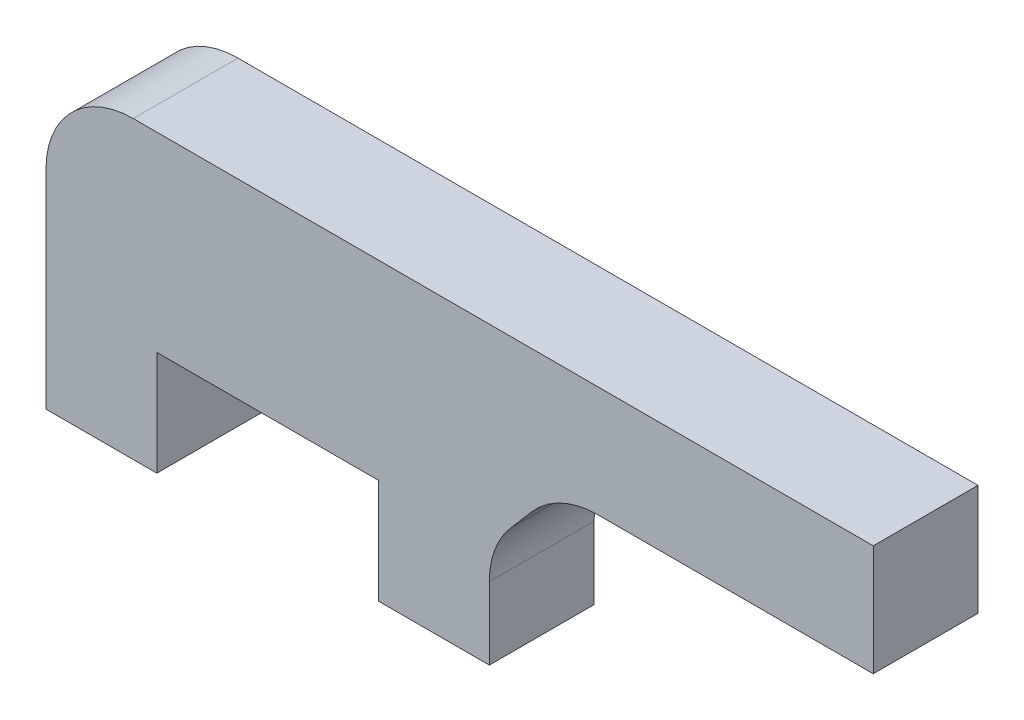
ISO-10303-21;
HEADER;
FILE_DESCRIPTION(('STEP AP214'),'2;1');
FILE_NAME('part.step','',(''),(''),'','','');
FILE_SCHEMA(('AUTOMOTIVE_DESIGN { 1 0 10303 214 1 1 1 1 }'));
ENDSEC;
DATA;
#1=APPLICATION_CONTEXT('core data for automotive mechanical design processes');
#2=APPLICATION_PROTOCOL_DEFINITION('international standard','automotive_design',2000,#1);
#3=PRODUCT_CONTEXT('',#1,'mechanical');
#4=PRODUCT('Part','Part','',(#3));
#5=PRODUCT_RELATED_PRODUCT_CATEGORY('part','',(#4));
#6=PRODUCT_DEFINITION_FORMATION('','',#4);
#7=PRODUCT_DEFINITION_CONTEXT('part definition',#1,'design');
#8=PRODUCT_DEFINITION('design','',#6,#7);
#9=PRODUCT_DEFINITION_SHAPE('','',#8);
#10=(LENGTH_UNIT() NAMED_UNIT(*) SI_UNIT(.MILLI.,.METRE.));
#11=(NAMED_UNIT(*) PLANE_ANGLE_UNIT() SI_UNIT($,.RADIAN.));
#12=(NAMED_UNIT(*) SI_UNIT($,.STERADIAN.) SOLID_ANGLE_UNIT());
#13=UNCERTAINTY_MEASURE_WITH_UNIT(LENGTH_MEASURE(1.E-05),#10,'distance_accuracy_value','');
#14=(GEOMETRIC_REPRESENTATION_CONTEXT(3) GLOBAL_UNCERTAINTY_ASSIGNED_CONTEXT((#13)) GLOBAL_UNIT_ASSIGNED_CONTEXT((#10,
#11,#12)) REPRESENTATION_CONTEXT('',''));
#15=CARTESIAN_POINT('',(0.,0.,0.));
#16=DIRECTION('',(0.,0.,1.));
#17=DIRECTION('',(1.,0.,0.));
#18=AXIS2_PLACEMENT_3D('',#15,#16,#17);
#19=CARTESIAN_POINT('',(642.289802478891,52.5443999999839,6.));
#20=DIRECTION('',(0.,0.,-1.));
#21=DIRECTION('',(-1.,0.,0.));
#22=AXIS2_PLACEMENT_3D('',#19,#20,#21);
#23=CYLINDRICAL_SURFACE('',#22,5.);
#24=CARTESIAN_POINT('',(642.289802478891,52.5443999999839,0.));
#25=DIRECTION('',(0.,0.,1.));
#26=DIRECTION('',(1.,0.,0.));
#27=AXIS2_PLACEMENT_3D('',#24,#25,#26);
#28=CIRCLE('',#27,5.);
#29=CARTESIAN_POINT('',(642.289802478891,57.5443999999839,0.));
#30=VERTEX_POINT('',#29);
#31=CARTESIAN_POINT('',(637.289802478891,52.5443999999839,0.));
#32=VERTEX_POINT('',#31);
#33=EDGE_CURVE('E167',#30,#32,#28,.T.);
#34=ORIENTED_EDGE('',*,*,#33,.T.);
#35=DIRECTION('',(0.,0.,-1.));
#36=VECTOR('',#35,1.);
#37=CARTESIAN_POINT('',(637.289802478891,52.5443999999839,6.));
#38=LINE('',#37,#36);
#39=CARTESIAN_POINT('',(637.289802478891,52.5443999999839,6.));
#40=VERTEX_POINT('',#39);
#41=EDGE_CURVE('E41',#40,#32,#38,.T.);
#42=ORIENTED_EDGE('',*,*,#41,.F.);
#43=CARTESIAN_POINT('',(642.289802478891,52.5443999999839,6.));
#44=DIRECTION('',(0.,0.,1.));
#45=DIRECTION('',(1.,0.,0.));
#46=AXIS2_PLACEMENT_3D('',#43,#44,#45);
#47=CIRCLE('',#46,5.);
#48=CARTESIAN_POINT('',(642.289802478891,57.5443999999839,6.));
#49=VERTEX_POINT('',#48);
#50=EDGE_CURVE('E106',#49,#40,#47,.T.);
#51=ORIENTED_EDGE('',*,*,#50,.F.);
#52=DIRECTION('',(0.,0.,-1.));
#53=VECTOR('',#52,1.);
#54=CARTESIAN_POINT('',(642.289802478891,57.5443999999839,6.));
#55=LINE('',#54,#53);
#56=EDGE_CURVE('E11',#49,#30,#55,.T.);
#57=ORIENTED_EDGE('',*,*,#56,.T.);
#58=EDGE_LOOP('',(#34,#42,#51,#57));
#59=FACE_BOUND('',#58,.T.);
#60=ADVANCED_FACE('F33',(#59),#23,.T.);
#61=CARTESIAN_POINT('',(637.289802478891,52.5443999999839,6.));
#62=DIRECTION('',(1.,0.,0.));
#63=DIRECTION('',(0.,0.,-1.));
#64=AXIS2_PLACEMENT_3D('',#61,#62,#63);
#65=PLANE('',#64);
#66=DIRECTION('',(0.,-1.,0.));
#67=VECTOR('',#66,1.);
#68=CARTESIAN_POINT('',(637.289802478891,52.5443999999839,0.));
#69=LINE('',#68,#67);
#70=CARTESIAN_POINT('',(637.289802478891,40.6230499999999,0.));
#71=VERTEX_POINT('',#70);
#72=EDGE_CURVE('E169',#32,#71,#69,.T.);
#73=ORIENTED_EDGE('',*,*,#72,.T.);
#74=DIRECTION('',(0.,0.,-1.));
#75=VECTOR('',#74,1.);
#76=CARTESIAN_POINT('',(637.289802478891,40.6230499999999,6.));
#77=LINE('',#76,#75);
#78=CARTESIAN_POINT('',(637.289802478891,40.6230499999999,6.));
#79=VERTEX_POINT('',#78);
#80=EDGE_CURVE('E220',#79,#71,#77,.T.);
#81=ORIENTED_EDGE('',*,*,#80,.F.);
#82=DIRECTION('',(0.,-1.,0.));
#83=VECTOR('',#82,1.);
#84=CARTESIAN_POINT('',(637.289802478891,52.5443999999839,6.));
#85=LINE('',#84,#83);
#86=EDGE_CURVE('E228',#40,#79,#85,.T.);
#87=ORIENTED_EDGE('',*,*,#86,.F.);
#88=ORIENTED_EDGE('',*,*,#41,.T.);
#89=EDGE_LOOP('',(#73,#81,#87,#88));
#90=FACE_BOUND('',#89,.T.);
#91=ADVANCED_FACE('F226',(#90),#65,.F.);
#92=CARTESIAN_POINT('',(637.289802478891,40.6230499999999,6.));
#93=DIRECTION('',(0.,1.,0.));
#94=DIRECTION('',(-1.,0.,0.));
#95=AXIS2_PLACEMENT_3D('',#92,#93,#94);
#96=PLANE('',#95);
#97=DIRECTION('',(1.,0.,0.));
#98=VECTOR('',#97,1.);
#99=CARTESIAN_POINT('',(637.289802478891,40.6230499999999,0.));
#100=LINE('',#99,#98);
#101=CARTESIAN_POINT('',(643.63980247889,40.6230499999999,0.));
#102=VERTEX_POINT('',#101);
#103=EDGE_CURVE('E171',#71,#102,#100,.T.);
#104=ORIENTED_EDGE('',*,*,#103,.T.);
#105=DIRECTION('',(0.,0.,-1.));
#106=VECTOR('',#105,1.);
#107=CARTESIAN_POINT('',(643.63980247889,40.6230499999999,6.));
#108=LINE('',#107,#106);
#109=CARTESIAN_POINT('',(643.63980247889,40.6230499999999,6.));
#110=VERTEX_POINT('',#109);
#111=EDGE_CURVE('E217',#110,#102,#108,.T.);
#112=ORIENTED_EDGE('',*,*,#111,.F.);
#113=DIRECTION('',(1.,0.,0.));
#114=VECTOR('',#113,1.);
#115=CARTESIAN_POINT('',(637.289802478891,40.6230499999999,6.));
#116=LINE('',#115,#114);
#117=EDGE_CURVE('E246',#79,#110,#116,.T.);
#118=ORIENTED_EDGE('',*,*,#117,.F.);
#119=ORIENTED_EDGE('',*,*,#80,.T.);
#120=EDGE_LOOP('',(#104,#112,#118,#119));
#121=FACE_BOUND('',#120,.T.);
#122=ADVANCED_FACE('F236',(#121),#96,.F.);
#123=CARTESIAN_POINT('',(643.63980247889,40.6230499999999,6.));
#124=DIRECTION('',(-1.,0.,0.));
#125=DIRECTION('',(0.,0.,1.));
#126=AXIS2_PLACEMENT_3D('',#123,#124,#125);
#127=PLANE('',#126);
#128=DIRECTION('',(0.,1.,0.));
#129=VECTOR('',#128,1.);
#130=CARTESIAN_POINT('',(643.63980247889,40.6230499999999,0.));
#131=LINE('',#130,#129);
#132=CARTESIAN_POINT('',(643.63980247889,46.6174499999999,0.));
#133=VERTEX_POINT('',#132);
#134=EDGE_CURVE('E173',#102,#133,#131,.T.);
#135=ORIENTED_EDGE('',*,*,#134,.T.);
#136=DIRECTION('',(0.,0.,-1.));
#137=VECTOR('',#136,1.);
#138=CARTESIAN_POINT('',(643.63980247889,46.6174499999999,6.));
#139=LINE('',#138,#137);
#140=CARTESIAN_POINT('',(643.63980247889,46.6174499999999,6.));
#141=VERTEX_POINT('',#140);
#142=EDGE_CURVE('E215',#141,#133,#139,.T.);
#143=ORIENTED_EDGE('',*,*,#142,.F.);
#144=DIRECTION('',(0.,1.,0.));
#145=VECTOR('',#144,1.);
#146=CARTESIAN_POINT('',(643.63980247889,40.6230499999999,6.));
#147=LINE('',#146,#145);
#148=EDGE_CURVE('E242',#110,#141,#147,.T.);
#149=ORIENTED_EDGE('',*,*,#148,.F.);
#150=ORIENTED_EDGE('',*,*,#111,.T.);
#151=EDGE_LOOP('',(#135,#143,#149,#150));
#152=FACE_BOUND('',#151,.T.);
#153=ADVANCED_FACE('F240',(#152),#127,.F.);
#154=CARTESIAN_POINT('',(656.339802478891,46.61745,6.));
#155=DIRECTION('',(0.,-1.,0.));
#156=DIRECTION('',(1.,0.,0.));
#157=AXIS2_PLACEMENT_3D('',#154,#155,#156);
#158=PLANE('',#157);
#159=DIRECTION('',(-1.,0.,0.));
#160=VECTOR('',#159,1.);
#161=CARTESIAN_POINT('',(656.339802478891,46.61745,0.));
#162=LINE('',#161,#160);
#163=CARTESIAN_POINT('',(656.339802478891,46.61745,0.));
#164=VERTEX_POINT('',#163);
#165=EDGE_CURVE('E176',#164,#133,#162,.T.);
#166=ORIENTED_EDGE('',*,*,#165,.F.);
#167=DIRECTION('',(0.,0.,-1.));
#168=VECTOR('',#167,1.);
#169=CARTESIAN_POINT('',(656.339802478891,46.61745,6.));
#170=LINE('',#169,#168);
#171=CARTESIAN_POINT('',(656.339802478891,46.61745,6.));
#172=VERTEX_POINT('',#171);
#173=EDGE_CURVE('E213',#172,#164,#170,.T.);
#174=ORIENTED_EDGE('',*,*,#173,.F.);
#175=DIRECTION('',(-1.,0.,0.));
#176=VECTOR('',#175,1.);
#177=CARTESIAN_POINT('',(656.339802478891,46.61745,6.));
#178=LINE('',#177,#176);
#179=EDGE_CURVE('E245',#172,#141,#178,.T.);
#180=ORIENTED_EDGE('',*,*,#179,.T.);
#181=ORIENTED_EDGE('',*,*,#142,.T.);
#182=EDGE_LOOP('',(#166,#174,#180,#181));
#183=FACE_BOUND('',#182,.T.);
#184=ADVANCED_FACE('F375',(#183),#158,.T.);
#185=CARTESIAN_POINT('',(656.339802478891,40.6230499999999,6.));
#186=DIRECTION('',(-1.,0.,0.));
#187=DIRECTION('',(0.,-1.,0.));
#188=AXIS2_PLACEMENT_3D('',#185,#186,#187);
#189=PLANE('',#188);
#190=DIRECTION('',(0.,1.,0.));
#191=VECTOR('',#190,1.);
#192=CARTESIAN_POINT('',(656.339802478891,40.6230499999999,0.));
#193=LINE('',#192,#191);
#194=CARTESIAN_POINT('',(656.339802478891,40.6230499999999,0.));
#195=VERTEX_POINT('',#194);
#196=EDGE_CURVE('E179',#195,#164,#193,.T.);
#197=ORIENTED_EDGE('',*,*,#196,.F.);
#198=DIRECTION('',(0.,0.,-1.));
#199=VECTOR('',#198,1.);
#200=CARTESIAN_POINT('',(656.339802478891,40.6230499999999,6.));
#201=LINE('',#200,#199);
#202=CARTESIAN_POINT('',(656.339802478891,40.6230499999999,6.));
#203=VERTEX_POINT('',#202);
#204=EDGE_CURVE('E211',#203,#195,#201,.T.);
#205=ORIENTED_EDGE('',*,*,#204,.F.);
#206=DIRECTION('',(0.,1.,0.));
#207=VECTOR('',#206,1.);
#208=CARTESIAN_POINT('',(656.339802478891,40.6230499999999,6.));
#209=LINE('',#208,#207);
#210=EDGE_CURVE('E248',#203,#172,#209,.T.);
#211=ORIENTED_EDGE('',*,*,#210,.T.);
#212=ORIENTED_EDGE('',*,*,#173,.T.);
#213=EDGE_LOOP('',(#197,#205,#211,#212));
#214=FACE_BOUND('',#213,.T.);
#215=ADVANCED_FACE('F365',(#214),#189,.T.);
#216=CARTESIAN_POINT('',(662.689802478891,40.62305,6.));
#217=DIRECTION('',(0.,-1.,0.));
#218=DIRECTION('',(1.,0.,0.));
#219=AXIS2_PLACEMENT_3D('',#216,#217,#218);
#220=PLANE('',#219);
#221=DIRECTION('',(-1.,0.,0.));
#222=VECTOR('',#221,1.);
#223=CARTESIAN_POINT('',(662.689802478891,40.62305,0.));
#224=LINE('',#223,#222);
#225=CARTESIAN_POINT('',(662.689802478891,40.62305,0.));
#226=VERTEX_POINT('',#225);
#227=EDGE_CURVE('E182',#226,#195,#224,.T.);
#228=ORIENTED_EDGE('',*,*,#227,.F.);
#229=DIRECTION('',(0.,0.,-1.));
#230=VECTOR('',#229,1.);
#231=CARTESIAN_POINT('',(662.689802478891,40.62305,6.));
#232=LINE('',#231,#230);
#233=CARTESIAN_POINT('',(662.689802478891,40.62305,6.));
#234=VERTEX_POINT('',#233);
#235=EDGE_CURVE('E209',#234,#226,#232,.T.);
#236=ORIENTED_EDGE('',*,*,#235,.F.);
#237=DIRECTION('',(-1.,0.,0.));
#238=VECTOR('',#237,1.);
#239=CARTESIAN_POINT('',(662.689802478891,40.62305,6.));
#240=LINE('',#239,#238);
#241=EDGE_CURVE('E255',#234,#203,#240,.T.);
#242=ORIENTED_EDGE('',*,*,#241,.T.);
#243=ORIENTED_EDGE('',*,*,#204,.T.);
#244=EDGE_LOOP('',(#228,#236,#242,#243));
#245=FACE_BOUND('',#244,.T.);
#246=ADVANCED_FACE('F356',(#245),#220,.T.);
#247=CARTESIAN_POINT('',(662.689802478889,44.7640723512734,6.));
#248=DIRECTION('',(1.,4.8258649067923E-13,0.));
#249=DIRECTION('',(-4.8258649067923E-13,1.,0.));
#250=AXIS2_PLACEMENT_3D('',#247,#248,#249);
#251=PLANE('',#250);
#252=DIRECTION('',(4.8258649067923E-13,-1.,0.));
#253=VECTOR('',#252,1.);
#254=CARTESIAN_POINT('',(662.689802478889,44.7640723512734,0.));
#255=LINE('',#254,#253);
#256=CARTESIAN_POINT('',(662.689802478889,44.7640723512734,0.));
#257=VERTEX_POINT('',#256);
#258=EDGE_CURVE('E185',#257,#226,#255,.T.);
#259=ORIENTED_EDGE('',*,*,#258,.F.);
#260=DIRECTION('',(0.,0.,-1.));
#261=VECTOR('',#260,1.);
#262=CARTESIAN_POINT('',(662.689802478889,44.7640723512734,6.));
#263=LINE('',#262,#261);
#264=CARTESIAN_POINT('',(662.689802478889,44.7640723512734,6.));
#265=VERTEX_POINT('',#264);
#266=EDGE_CURVE('E207',#265,#257,#263,.T.);
#267=ORIENTED_EDGE('',*,*,#266,.F.);
#268=DIRECTION('',(4.8258649067923E-13,-1.,0.));
#269=VECTOR('',#268,1.);
#270=CARTESIAN_POINT('',(662.689802478889,44.7640723512734,6.));
#271=LINE('',#270,#269);
#272=EDGE_CURVE('E258',#265,#234,#271,.T.);
#273=ORIENTED_EDGE('',*,*,#272,.T.);
#274=ORIENTED_EDGE('',*,*,#235,.T.);
#275=EDGE_LOOP('',(#259,#267,#273,#274));
#276=FACE_BOUND('',#275,.T.);
#277=ADVANCED_FACE('F271',(#276),#251,.T.);
#278=CARTESIAN_POINT('',(667.689802478889,44.7640723512734,6.));
#279=DIRECTION('',(0.,0.,-1.));
#280=DIRECTION('',(-1.,0.,0.));
#281=AXIS2_PLACEMENT_3D('',#278,#279,#280);
#282=CYLINDRICAL_SURFACE('',#281,5.00000000000002);
#283=CARTESIAN_POINT('',(667.689802478889,44.7640723512734,0.));
#284=DIRECTION('',(0.,0.,1.));
#285=DIRECTION('',(1.,0.,0.));
#286=AXIS2_PLACEMENT_3D('',#283,#284,#285);
#287=CIRCLE('',#286,5.00000000000002);
#288=CARTESIAN_POINT('',(663.897823458931,48.0230438320018,0.));
#289=VERTEX_POINT('',#288);
#290=EDGE_CURVE('E188',#289,#257,#287,.T.);
#291=ORIENTED_EDGE('',*,*,#290,.F.);
#292=DIRECTION('',(0.,0.,-1.));
#293=VECTOR('',#292,1.);
#294=CARTESIAN_POINT('',(663.897823458931,48.0230438320018,6.));
#295=LINE('',#294,#293);
#296=CARTESIAN_POINT('',(663.897823458931,48.0230438320018,6.));
#297=VERTEX_POINT('',#296);
#298=EDGE_CURVE('E205',#297,#289,#295,.T.);
#299=ORIENTED_EDGE('',*,*,#298,.F.);
#300=CARTESIAN_POINT('',(667.689802478889,44.7640723512734,6.));
#301=DIRECTION('',(0.,0.,1.));
#302=DIRECTION('',(1.,0.,0.));
#303=AXIS2_PLACEMENT_3D('',#300,#301,#302);
#304=CIRCLE('',#303,5.00000000000002);
#305=EDGE_CURVE('E261',#297,#265,#304,.T.);
#306=ORIENTED_EDGE('',*,*,#305,.T.);
#307=ORIENTED_EDGE('',*,*,#266,.T.);
#308=EDGE_LOOP('',(#291,#299,#306,#307));
#309=FACE_BOUND('',#308,.T.);
#310=ADVANCED_FACE('F265',(#309),#282,.F.);
#311=CARTESIAN_POINT('',(663.897823458931,48.0230438320018,6.));
#312=DIRECTION('',(-0.75839580399147,0.651794296145748,0.));
#313=DIRECTION('',(-0.651794296145748,-0.75839580399147,0.));
#314=AXIS2_PLACEMENT_3D('',#311,#312,#313);
#315=PLANE('',#314);
#316=DIRECTION('',(0.651794296145748,0.75839580399147,0.));
#317=VECTOR('',#316,1.);
#318=CARTESIAN_POINT('',(663.897823458931,48.0230438320018,0.));
#319=LINE('',#318,#317);
#320=CARTESIAN_POINT('',(665.127101624953,49.4533714807122,0.));
#321=VERTEX_POINT('',#320);
#322=EDGE_CURVE('E191',#289,#321,#319,.T.);
#323=ORIENTED_EDGE('',*,*,#322,.T.);
#324=DIRECTION('',(0.,0.,-1.));
#325=VECTOR('',#324,1.);
#326=CARTESIAN_POINT('',(665.127101624953,49.4533714807122,6.));
#327=LINE('',#326,#325);
#328=CARTESIAN_POINT('',(665.127101624953,49.4533714807122,6.));
#329=VERTEX_POINT('',#328);
#330=EDGE_CURVE('E159',#329,#321,#327,.T.);
#331=ORIENTED_EDGE('',*,*,#330,.F.);
#332=DIRECTION('',(0.651794296145748,0.75839580399147,0.));
#333=VECTOR('',#332,1.);
#334=CARTESIAN_POINT('',(663.897823458931,48.0230438320018,6.));
#335=LINE('',#334,#333);
#336=EDGE_CURVE('E147',#297,#329,#335,.T.);
#337=ORIENTED_EDGE('',*,*,#336,.F.);
#338=ORIENTED_EDGE('',*,*,#298,.T.);
#339=EDGE_LOOP('',(#323,#331,#337,#338));
#340=FACE_BOUND('',#339,.T.);
#341=ADVANCED_FACE('F275',(#340),#315,.F.);
#342=CARTESIAN_POINT('',(668.91908064491,46.1943999999839,6.));
#343=DIRECTION('',(0.,0.,-1.));
#344=DIRECTION('',(-1.,0.,0.));
#345=AXIS2_PLACEMENT_3D('',#342,#343,#344);
#346=CYLINDRICAL_SURFACE('',#345,4.99999999999998);
#347=CARTESIAN_POINT('',(668.91908064491,46.1943999999839,0.));
#348=DIRECTION('',(0.,0.,-1.));
#349=DIRECTION('',(-1.,0.,0.));
#350=AXIS2_PLACEMENT_3D('',#347,#348,#349);
#351=CIRCLE('',#350,4.99999999999998);
#352=CARTESIAN_POINT('',(668.91908064491,51.1943999999839,0.));
#353=VERTEX_POINT('',#352);
#354=EDGE_CURVE('E156',#321,#353,#351,.T.);
#355=ORIENTED_EDGE('',*,*,#354,.T.);
#356=DIRECTION('',(0.,0.,-1.));
#357=VECTOR('',#356,1.);
#358=CARTESIAN_POINT('',(668.91908064491,51.1943999999839,6.));
#359=LINE('',#358,#357);
#360=CARTESIAN_POINT('',(668.91908064491,51.1943999999839,6.));
#361=VERTEX_POINT('',#360);
#362=EDGE_CURVE('E153',#361,#353,#359,.T.);
#363=ORIENTED_EDGE('',*,*,#362,.F.);
#364=CARTESIAN_POINT('',(668.91908064491,46.1943999999839,6.));
#365=DIRECTION('',(0.,0.,-1.));
#366=DIRECTION('',(-1.,0.,0.));
#367=AXIS2_PLACEMENT_3D('',#364,#365,#366);
#368=CIRCLE('',#367,4.99999999999998);
#369=EDGE_CURVE('E139',#329,#361,#368,.T.);
#370=ORIENTED_EDGE('',*,*,#369,.F.);
#371=ORIENTED_EDGE('',*,*,#330,.T.);
#372=EDGE_LOOP('',(#355,#363,#370,#371));
#373=FACE_BOUND('',#372,.T.);
#374=ADVANCED_FACE('F154',(#373),#346,.F.);
#375=CARTESIAN_POINT('',(684.68980247883,51.1943999999839,6.));
#376=DIRECTION('',(0.,-1.,0.));
#377=DIRECTION('',(1.,0.,0.));
#378=AXIS2_PLACEMENT_3D('',#375,#376,#377);
#379=PLANE('',#378);
#380=DIRECTION('',(-1.,0.,0.));
#381=VECTOR('',#380,1.);
#382=CARTESIAN_POINT('',(684.68980247883,51.1943999999839,0.));
#383=LINE('',#382,#381);
#384=CARTESIAN_POINT('',(684.68980247883,51.1943999999839,0.));
#385=VERTEX_POINT('',#384);
#386=EDGE_CURVE('E194',#385,#353,#383,.T.);
#387=ORIENTED_EDGE('',*,*,#386,.F.);
#388=DIRECTION('',(0.,0.,-1.));
#389=VECTOR('',#388,1.);
#390=CARTESIAN_POINT('',(684.68980247883,51.1943999999839,6.));
#391=LINE('',#390,#389);
#392=CARTESIAN_POINT('',(684.68980247883,51.1943999999839,6.));
#393=VERTEX_POINT('',#392);
#394=EDGE_CURVE('E96',#393,#385,#391,.T.);
#395=ORIENTED_EDGE('',*,*,#394,.F.);
#396=DIRECTION('',(-1.,0.,0.));
#397=VECTOR('',#396,1.);
#398=CARTESIAN_POINT('',(684.68980247883,51.1943999999839,6.));
#399=LINE('',#398,#397);
#400=EDGE_CURVE('E144',#393,#361,#399,.T.);
#401=ORIENTED_EDGE('',*,*,#400,.T.);
#402=ORIENTED_EDGE('',*,*,#362,.T.);
#403=EDGE_LOOP('',(#387,#395,#401,#402));
#404=FACE_BOUND('',#403,.T.);
#405=ADVANCED_FACE('F161',(#404),#379,.T.);
#406=CARTESIAN_POINT('',(684.68980247883,57.5443999999839,6.));
#407=DIRECTION('',(1.,0.,0.));
#408=DIRECTION('',(0.,0.,-1.));
#409=AXIS2_PLACEMENT_3D('',#406,#407,#408);
#410=PLANE('',#409);
#411=DIRECTION('',(0.,-1.,0.));
#412=VECTOR('',#411,1.);
#413=CARTESIAN_POINT('',(684.68980247883,57.5443999999839,0.));
#414=LINE('',#413,#412);
#415=CARTESIAN_POINT('',(684.68980247883,57.5443999999839,0.));
#416=VERTEX_POINT('',#415);
#417=EDGE_CURVE('E196',#416,#385,#414,.T.);
#418=ORIENTED_EDGE('',*,*,#417,.F.);
#419=DIRECTION('',(0.,0.,-1.));
#420=VECTOR('',#419,1.);
#421=CARTESIAN_POINT('',(684.68980247883,57.5443999999839,6.));
#422=LINE('',#421,#420);
#423=CARTESIAN_POINT('',(684.68980247883,57.5443999999839,6.));
#424=VERTEX_POINT('',#423);
#425=EDGE_CURVE('E99',#424,#416,#422,.T.);
#426=ORIENTED_EDGE('',*,*,#425,.F.);
#427=DIRECTION('',(0.,-1.,0.));
#428=VECTOR('',#427,1.);
#429=CARTESIAN_POINT('',(684.68980247883,57.5443999999839,6.));
#430=LINE('',#429,#428);
#431=EDGE_CURVE('E162',#424,#393,#430,.T.);
#432=ORIENTED_EDGE('',*,*,#431,.T.);
#433=ORIENTED_EDGE('',*,*,#394,.T.);
#434=EDGE_LOOP('',(#418,#426,#432,#433));
#435=FACE_BOUND('',#434,.T.);
#436=ADVANCED_FACE('F289',(#435),#410,.T.);
#437=CARTESIAN_POINT('',(662.689802478889,57.5443999999839,6.));
#438=DIRECTION('',(0.,1.,0.));
#439=DIRECTION('',(-1.,0.,0.));
#440=AXIS2_PLACEMENT_3D('',#437,#438,#439);
#441=PLANE('',#440);
#442=DIRECTION('',(1.,0.,0.));
#443=VECTOR('',#442,1.);
#444=CARTESIAN_POINT('',(662.689802478889,57.5443999999839,0.));
#445=LINE('',#444,#443);
#446=EDGE_CURVE('E199',#30,#416,#445,.T.);
#447=ORIENTED_EDGE('',*,*,#446,.F.);
#448=ORIENTED_EDGE('',*,*,#56,.F.);
#449=DIRECTION('',(-1.,0.,0.));
#450=VECTOR('',#449,1.);
#451=CARTESIAN_POINT('',(662.689802478889,57.5443999999839,6.));
#452=LINE('',#451,#450);
#453=EDGE_CURVE('E49',#424,#49,#452,.T.);
#454=ORIENTED_EDGE('',*,*,#453,.F.);
#455=ORIENTED_EDGE('',*,*,#425,.T.);
#456=EDGE_LOOP('',(#447,#448,#454,#455));
#457=FACE_BOUND('',#456,.T.);
#458=ADVANCED_FACE('F288',(#457),#441,.T.);
#459=CARTESIAN_POINT('',(642.289802478891,52.5443999999839,6.));
#460=DIRECTION('',(0.,0.,1.));
#461=DIRECTION('',(1.,0.,0.));
#462=AXIS2_PLACEMENT_3D('',#459,#460,#461);
#463=PLANE('',#462);
#464=ORIENTED_EDGE('',*,*,#453,.T.);
#465=ORIENTED_EDGE('',*,*,#50,.T.);
#466=ORIENTED_EDGE('',*,*,#86,.T.);
#467=ORIENTED_EDGE('',*,*,#117,.T.);
#468=ORIENTED_EDGE('',*,*,#148,.T.);
#469=ORIENTED_EDGE('',*,*,#179,.F.);
#470=ORIENTED_EDGE('',*,*,#210,.F.);
#471=ORIENTED_EDGE('',*,*,#241,.F.);
#472=ORIENTED_EDGE('',*,*,#272,.F.);
#473=ORIENTED_EDGE('',*,*,#305,.F.);
#474=ORIENTED_EDGE('',*,*,#336,.T.);
#475=ORIENTED_EDGE('',*,*,#369,.T.);
#476=ORIENTED_EDGE('',*,*,#400,.F.);
#477=ORIENTED_EDGE('',*,*,#431,.F.);
#478=EDGE_LOOP('',(#464,#465,#466,#467,#468,#469,#470,#471,#472,#473,#474,#475,#476,#477));
#479=FACE_BOUND('',#478,.T.);
#480=ADVANCED_FACE('F141',(#479),#463,.T.);
#481=CARTESIAN_POINT('',(642.289802478891,52.5443999999839,0.));
#482=DIRECTION('',(0.,0.,1.));
#483=DIRECTION('',(1.,0.,0.));
#484=AXIS2_PLACEMENT_3D('',#481,#482,#483);
#485=PLANE('',#484);
#486=ORIENTED_EDGE('',*,*,#33,.F.);
#487=ORIENTED_EDGE('',*,*,#446,.T.);
#488=ORIENTED_EDGE('',*,*,#417,.T.);
#489=ORIENTED_EDGE('',*,*,#386,.T.);
#490=ORIENTED_EDGE('',*,*,#354,.F.);
#491=ORIENTED_EDGE('',*,*,#322,.F.);
#492=ORIENTED_EDGE('',*,*,#290,.T.);
#493=ORIENTED_EDGE('',*,*,#258,.T.);
#494=ORIENTED_EDGE('',*,*,#227,.T.);
#495=ORIENTED_EDGE('',*,*,#196,.T.);
#496=ORIENTED_EDGE('',*,*,#165,.T.);
#497=ORIENTED_EDGE('',*,*,#134,.F.);
#498=ORIENTED_EDGE('',*,*,#103,.F.);
#499=ORIENTED_EDGE('',*,*,#72,.F.);
#500=EDGE_LOOP('',(#486,#487,#488,#489,#490,#491,#492,#493,#494,#495,#496,#497,#498,#499));
#501=FACE_BOUND('',#500,.T.);
#502=ADVANCED_FACE('F232',(#501),#485,.F.);
#503=CLOSED_SHELL('',(#60,#91,#122,#153,#184,#215,#246,#277,#310,#341,#374,#405,#436,#458,#480,#502));
#504=MANIFOLD_SOLID_BREP('B2',#503);
#505=ADVANCED_BREP_SHAPE_REPRESENTATION('',(#18,#504),#14);
#506=SHAPE_DEFINITION_REPRESENTATION(#9,#505);
ENDSEC;
END-ISO-10303-21;
